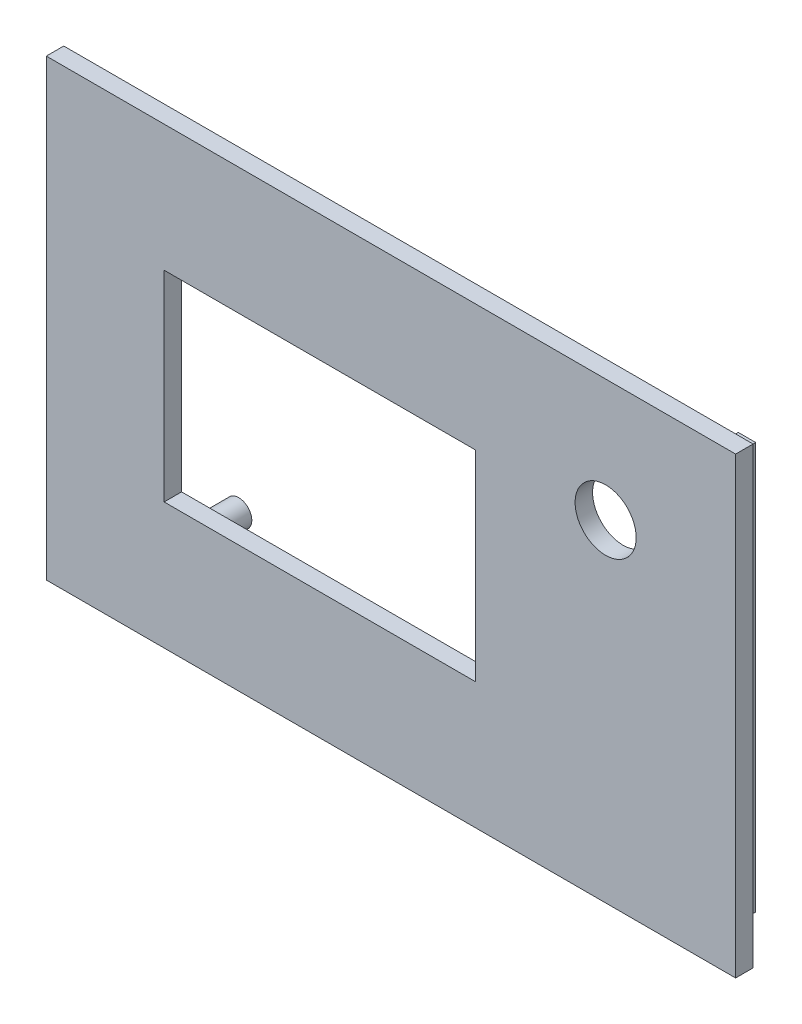
ISO-10303-21;
HEADER;
FILE_DESCRIPTION(('STEP AP214'),'2;1');
FILE_NAME('part.step','',(''),(''),'','','');
FILE_SCHEMA(('AUTOMOTIVE_DESIGN { 1 0 10303 214 1 1 1 1 }'));
ENDSEC;
DATA;
#1=APPLICATION_CONTEXT('core data for automotive mechanical design processes');
#2=APPLICATION_PROTOCOL_DEFINITION('international standard','automotive_design',2000,#1);
#3=PRODUCT_CONTEXT('',#1,'mechanical');
#4=PRODUCT('Part','Part','',(#3));
#5=PRODUCT_RELATED_PRODUCT_CATEGORY('part','',(#4));
#6=PRODUCT_DEFINITION_FORMATION('','',#4);
#7=PRODUCT_DEFINITION_CONTEXT('part definition',#1,'design');
#8=PRODUCT_DEFINITION('design','',#6,#7);
#9=PRODUCT_DEFINITION_SHAPE('','',#8);
#10=(LENGTH_UNIT() NAMED_UNIT(*) SI_UNIT(.MILLI.,.METRE.));
#11=(NAMED_UNIT(*) PLANE_ANGLE_UNIT() SI_UNIT($,.RADIAN.));
#12=(NAMED_UNIT(*) SI_UNIT($,.STERADIAN.) SOLID_ANGLE_UNIT());
#13=UNCERTAINTY_MEASURE_WITH_UNIT(LENGTH_MEASURE(1.E-05),#10,'distance_accuracy_value','');
#14=(GEOMETRIC_REPRESENTATION_CONTEXT(3) GLOBAL_UNCERTAINTY_ASSIGNED_CONTEXT((#13)) GLOBAL_UNIT_ASSIGNED_CONTEXT((#10,
#11,#12)) REPRESENTATION_CONTEXT('',''));
#15=CARTESIAN_POINT('',(0.,0.,0.));
#16=DIRECTION('',(0.,0.,1.));
#17=DIRECTION('',(1.,0.,0.));
#18=AXIS2_PLACEMENT_3D('',#15,#16,#17);
#19=CARTESIAN_POINT('',(0.,0.,0.));
#20=DIRECTION('',(0.,0.,1.));
#21=DIRECTION('',(1.,0.,0.));
#22=AXIS2_PLACEMENT_3D('',#19,#20,#21);
#23=PLANE('',#22);
#24=DIRECTION('',(0.,-1.,0.));
#25=VECTOR('',#24,1.);
#26=CARTESIAN_POINT('',(-59.4904214559387,-2.40229885057471,0.));
#27=LINE('',#26,#25);
#28=CARTESIAN_POINT('',(-59.4904214559387,-2.40229885057471,0.));
#29=VERTEX_POINT('',#28);
#30=CARTESIAN_POINT('',(-59.4904214559387,-54.4022988505747,0.));
#31=VERTEX_POINT('',#30);
#32=EDGE_CURVE('E205',#29,#31,#27,.T.);
#33=ORIENTED_EDGE('',*,*,#32,.F.);
#34=DIRECTION('',(-1.,0.,0.));
#35=VECTOR('',#34,1.);
#36=CARTESIAN_POINT('',(-59.4904214559387,-2.40229885057471,0.));
#37=LINE('',#36,#35);
#38=CARTESIAN_POINT('',(19.5095785440613,-2.40229885057471,0.));
#39=VERTEX_POINT('',#38);
#40=EDGE_CURVE('E216',#39,#29,#37,.T.);
#41=ORIENTED_EDGE('',*,*,#40,.F.);
#42=DIRECTION('',(0.,1.,0.));
#43=VECTOR('',#42,1.);
#44=CARTESIAN_POINT('',(19.5095785440613,-2.40229885057471,0.));
#45=LINE('',#44,#43);
#46=CARTESIAN_POINT('',(19.5095785440613,-54.4022988505747,0.));
#47=VERTEX_POINT('',#46);
#48=EDGE_CURVE('E227',#47,#39,#45,.T.);
#49=ORIENTED_EDGE('',*,*,#48,.F.);
#50=DIRECTION('',(1.,0.,0.));
#51=VECTOR('',#50,1.);
#52=CARTESIAN_POINT('',(-59.4904214559387,-54.4022988505747,0.));
#53=LINE('',#52,#51);
#54=EDGE_CURVE('E225',#31,#47,#53,.T.);
#55=ORIENTED_EDGE('',*,*,#54,.F.);
#56=EDGE_LOOP('',(#33,#41,#49,#55));
#57=FACE_BOUND('',#56,.T.);
#58=DIRECTION('',(-1.,0.,0.));
#59=VECTOR('',#58,1.);
#60=CARTESIAN_POINT('',(-45.9869726842383,-16.9022988505747,0.));
#61=LINE('',#60,#59);
#62=CARTESIAN_POINT('',(-10.2869726842383,-16.9022988505747,0.));
#63=VERTEX_POINT('',#62);
#64=CARTESIAN_POINT('',(-45.9869726842383,-16.9022988505747,0.));
#65=VERTEX_POINT('',#64);
#66=EDGE_CURVE('E190',#63,#65,#61,.T.);
#67=ORIENTED_EDGE('',*,*,#66,.T.);
#68=DIRECTION('',(0.,-1.,0.));
#69=VECTOR('',#68,1.);
#70=CARTESIAN_POINT('',(-45.9869726842383,-16.9022988505747,0.));
#71=LINE('',#70,#69);
#72=CARTESIAN_POINT('',(-45.9869726842383,-39.9022988505747,0.));
#73=VERTEX_POINT('',#72);
#74=EDGE_CURVE('E180',#65,#73,#71,.T.);
#75=ORIENTED_EDGE('',*,*,#74,.T.);
#76=DIRECTION('',(1.,0.,0.));
#77=VECTOR('',#76,1.);
#78=CARTESIAN_POINT('',(-45.9869726842383,-39.9022988505747,0.));
#79=LINE('',#78,#77);
#80=CARTESIAN_POINT('',(-10.2869726842383,-39.9022988505747,0.));
#81=VERTEX_POINT('',#80);
#82=EDGE_CURVE('E183',#73,#81,#79,.T.);
#83=ORIENTED_EDGE('',*,*,#82,.T.);
#84=DIRECTION('',(0.,1.,0.));
#85=VECTOR('',#84,1.);
#86=CARTESIAN_POINT('',(-10.2869726842383,-16.9022988505747,0.));
#87=LINE('',#86,#85);
#88=EDGE_CURVE('E187',#81,#63,#87,.T.);
#89=ORIENTED_EDGE('',*,*,#88,.T.);
#90=EDGE_LOOP('',(#67,#75,#83,#89));
#91=FACE_BOUND('',#90,.T.);
#92=CARTESIAN_POINT('',(4.61130292991151,-16.4022988505747,0.));
#93=DIRECTION('',(0.,0.,1.));
#94=DIRECTION('',(1.,0.,0.));
#95=AXIS2_PLACEMENT_3D('',#92,#93,#94);
#96=CIRCLE('',#95,3.5);
#97=CARTESIAN_POINT('',(8.1113029299115,-16.4022988505747,0.));
#98=VERTEX_POINT('',#97);
#99=EDGE_CURVE('E174',#98,#98,#96,.T.);
#100=ORIENTED_EDGE('',*,*,#99,.T.);
#101=EDGE_LOOP('',(#100));
#102=FACE_BOUND('',#101,.T.);
#103=CARTESIAN_POINT('',(-43.4369726842383,-14.1022988505747,0.));
#104=DIRECTION('',(0.,0.,1.));
#105=DIRECTION('',(1.,0.,0.));
#106=AXIS2_PLACEMENT_3D('',#103,#104,#105);
#107=CIRCLE('',#106,1.50000000000001);
#108=CARTESIAN_POINT('',(-41.9369726842383,-14.1022988505747,0.));
#109=VERTEX_POINT('',#108);
#110=EDGE_CURVE('E241',#109,#109,#107,.F.);
#111=ORIENTED_EDGE('',*,*,#110,.F.);
#112=EDGE_LOOP('',(#111));
#113=FACE_BOUND('',#112,.T.);
#114=CARTESIAN_POINT('',(-43.4369726842383,-42.7022988505747,0.));
#115=DIRECTION('',(0.,0.,1.));
#116=DIRECTION('',(1.,0.,0.));
#117=AXIS2_PLACEMENT_3D('',#114,#115,#116);
#118=CIRCLE('',#117,1.50000000000002);
#119=CARTESIAN_POINT('',(-41.9369726842383,-42.7022988505747,0.));
#120=VERTEX_POINT('',#119);
#121=EDGE_CURVE('E244',#120,#120,#118,.F.);
#122=ORIENTED_EDGE('',*,*,#121,.F.);
#123=EDGE_LOOP('',(#122));
#124=FACE_BOUND('',#123,.T.);
#125=CARTESIAN_POINT('',(-12.8369726842383,-14.1022988505747,0.));
#126=DIRECTION('',(0.,0.,1.));
#127=DIRECTION('',(1.,0.,0.));
#128=AXIS2_PLACEMENT_3D('',#125,#126,#127);
#129=CIRCLE('',#128,1.50000000000001);
#130=CARTESIAN_POINT('',(-11.3369726842383,-14.1022988505747,0.));
#131=VERTEX_POINT('',#130);
#132=EDGE_CURVE('E42',#131,#131,#129,.F.);
#133=ORIENTED_EDGE('',*,*,#132,.F.);
#134=EDGE_LOOP('',(#133));
#135=FACE_BOUND('',#134,.T.);
#136=CARTESIAN_POINT('',(-12.8369726842383,-42.7022988505747,0.));
#137=DIRECTION('',(0.,0.,1.));
#138=DIRECTION('',(1.,0.,0.));
#139=AXIS2_PLACEMENT_3D('',#136,#137,#138);
#140=CIRCLE('',#139,1.50000000000001);
#141=CARTESIAN_POINT('',(-11.3369726842383,-42.7022988505747,0.));
#142=VERTEX_POINT('',#141);
#143=EDGE_CURVE('E11',#142,#142,#140,.F.);
#144=ORIENTED_EDGE('',*,*,#143,.F.);
#145=EDGE_LOOP('',(#144));
#146=FACE_BOUND('',#145,.T.);
#147=DIRECTION('',(1.,0.,0.));
#148=VECTOR('',#147,1.);
#149=CARTESIAN_POINT('',(16.8095785440613,-5.10229885057473,0.));
#150=LINE('',#149,#148);
#151=CARTESIAN_POINT('',(14.8095785440613,-5.10229885057471,0.));
#152=VERTEX_POINT('',#151);
#153=CARTESIAN_POINT('',(16.8095785440613,-5.10229885057473,0.));
#154=VERTEX_POINT('',#153);
#155=EDGE_CURVE('E155',#152,#154,#150,.T.);
#156=ORIENTED_EDGE('',*,*,#155,.F.);
#157=DIRECTION('',(0.,1.,0.));
#158=VECTOR('',#157,1.);
#159=CARTESIAN_POINT('',(14.8095785440613,-5.10229885057471,0.));
#160=LINE('',#159,#158);
#161=CARTESIAN_POINT('',(14.8095785440613,-49.7022988505747,0.));
#162=VERTEX_POINT('',#161);
#163=EDGE_CURVE('E152',#162,#152,#160,.T.);
#164=ORIENTED_EDGE('',*,*,#163,.F.);
#165=DIRECTION('',(1.,0.,0.));
#166=VECTOR('',#165,1.);
#167=CARTESIAN_POINT('',(14.8095785440613,-49.7022988505747,0.));
#168=LINE('',#167,#166);
#169=CARTESIAN_POINT('',(-56.7904214559387,-49.7022988505747,0.));
#170=VERTEX_POINT('',#169);
#171=EDGE_CURVE('E265',#170,#162,#168,.T.);
#172=ORIENTED_EDGE('',*,*,#171,.F.);
#173=DIRECTION('',(0.,1.,0.));
#174=VECTOR('',#173,1.);
#175=CARTESIAN_POINT('',(-56.7904214559387,-51.7022988505747,0.));
#176=LINE('',#175,#174);
#177=CARTESIAN_POINT('',(-56.7904214559387,-51.7022988505747,0.));
#178=VERTEX_POINT('',#177);
#179=EDGE_CURVE('E282',#178,#170,#176,.T.);
#180=ORIENTED_EDGE('',*,*,#179,.F.);
#181=DIRECTION('',(-1.,0.,0.));
#182=VECTOR('',#181,1.);
#183=CARTESIAN_POINT('',(16.8095785440613,-51.7022988505747,0.));
#184=LINE('',#183,#182);
#185=CARTESIAN_POINT('',(16.8095785440613,-51.7022988505747,0.));
#186=VERTEX_POINT('',#185);
#187=EDGE_CURVE('E54',#186,#178,#184,.T.);
#188=ORIENTED_EDGE('',*,*,#187,.F.);
#189=DIRECTION('',(0.,-1.,0.));
#190=VECTOR('',#189,1.);
#191=CARTESIAN_POINT('',(16.8095785440613,-5.10229885057473,0.));
#192=LINE('',#191,#190);
#193=EDGE_CURVE('E49',#154,#186,#192,.T.);
#194=ORIENTED_EDGE('',*,*,#193,.F.);
#195=EDGE_LOOP('',(#156,#164,#172,#180,#188,#194));
#196=FACE_BOUND('',#195,.T.);
#197=ADVANCED_FACE('F34',(#57,#91,#102,#113,#124,#135,#146,#196),#23,.F.);
#198=CARTESIAN_POINT('',(-59.4904214559387,-2.40229885057471,2.));
#199=DIRECTION('',(1.,0.,0.));
#200=DIRECTION('',(0.,1.,0.));
#201=AXIS2_PLACEMENT_3D('',#198,#199,#200);
#202=PLANE('',#201);
#203=ORIENTED_EDGE('',*,*,#32,.T.);
#204=DIRECTION('',(0.,0.,-1.));
#205=VECTOR('',#204,1.);
#206=CARTESIAN_POINT('',(-59.4904214559387,-54.4022988505747,2.));
#207=LINE('',#206,#205);
#208=CARTESIAN_POINT('',(-59.4904214559387,-54.4022988505747,2.));
#209=VERTEX_POINT('',#208);
#210=EDGE_CURVE('E238',#209,#31,#207,.T.);
#211=ORIENTED_EDGE('',*,*,#210,.F.);
#212=DIRECTION('',(0.,-1.,0.));
#213=VECTOR('',#212,1.);
#214=CARTESIAN_POINT('',(-59.4904214559387,-2.40229885057471,2.));
#215=LINE('',#214,#213);
#216=CARTESIAN_POINT('',(-59.4904214559387,-2.40229885057471,2.));
#217=VERTEX_POINT('',#216);
#218=EDGE_CURVE('E212',#217,#209,#215,.T.);
#219=ORIENTED_EDGE('',*,*,#218,.F.);
#220=DIRECTION('',(0.,0.,-1.));
#221=VECTOR('',#220,1.);
#222=CARTESIAN_POINT('',(-59.4904214559387,-2.40229885057471,2.));
#223=LINE('',#222,#221);
#224=EDGE_CURVE('E222',#217,#29,#223,.T.);
#225=ORIENTED_EDGE('',*,*,#224,.T.);
#226=EDGE_LOOP('',(#203,#211,#219,#225));
#227=FACE_BOUND('',#226,.T.);
#228=ADVANCED_FACE('F36',(#227),#202,.F.);
#229=CARTESIAN_POINT('',(-59.4904214559387,-54.4022988505747,2.));
#230=DIRECTION('',(0.,1.,0.));
#231=DIRECTION('',(0.,0.,1.));
#232=AXIS2_PLACEMENT_3D('',#229,#230,#231);
#233=PLANE('',#232);
#234=ORIENTED_EDGE('',*,*,#54,.T.);
#235=DIRECTION('',(0.,0.,-1.));
#236=VECTOR('',#235,1.);
#237=CARTESIAN_POINT('',(19.5095785440613,-54.4022988505747,2.));
#238=LINE('',#237,#236);
#239=CARTESIAN_POINT('',(19.5095785440613,-54.4022988505747,2.));
#240=VERTEX_POINT('',#239);
#241=EDGE_CURVE('E235',#240,#47,#238,.T.);
#242=ORIENTED_EDGE('',*,*,#241,.F.);
#243=DIRECTION('',(1.,0.,0.));
#244=VECTOR('',#243,1.);
#245=CARTESIAN_POINT('',(-59.4904214559387,-54.4022988505747,2.));
#246=LINE('',#245,#244);
#247=EDGE_CURVE('E215',#209,#240,#246,.T.);
#248=ORIENTED_EDGE('',*,*,#247,.F.);
#249=ORIENTED_EDGE('',*,*,#210,.T.);
#250=EDGE_LOOP('',(#234,#242,#248,#249));
#251=FACE_BOUND('',#250,.T.);
#252=ADVANCED_FACE('F372',(#251),#233,.F.);
#253=CARTESIAN_POINT('',(19.5095785440613,-2.40229885057471,2.));
#254=DIRECTION('',(-1.,0.,0.));
#255=DIRECTION('',(0.,-1.,0.));
#256=AXIS2_PLACEMENT_3D('',#253,#254,#255);
#257=PLANE('',#256);
#258=ORIENTED_EDGE('',*,*,#48,.T.);
#259=DIRECTION('',(0.,0.,-1.));
#260=VECTOR('',#259,1.);
#261=CARTESIAN_POINT('',(19.5095785440613,-2.40229885057471,2.));
#262=LINE('',#261,#260);
#263=CARTESIAN_POINT('',(19.5095785440613,-2.40229885057471,2.));
#264=VERTEX_POINT('',#263);
#265=EDGE_CURVE('E232',#264,#39,#262,.T.);
#266=ORIENTED_EDGE('',*,*,#265,.F.);
#267=DIRECTION('',(0.,1.,0.));
#268=VECTOR('',#267,1.);
#269=CARTESIAN_POINT('',(19.5095785440613,-2.40229885057471,2.));
#270=LINE('',#269,#268);
#271=EDGE_CURVE('E218',#240,#264,#270,.T.);
#272=ORIENTED_EDGE('',*,*,#271,.F.);
#273=ORIENTED_EDGE('',*,*,#241,.T.);
#274=EDGE_LOOP('',(#258,#266,#272,#273));
#275=FACE_BOUND('',#274,.T.);
#276=ADVANCED_FACE('F369',(#275),#257,.F.);
#277=CARTESIAN_POINT('',(-59.4904214559387,-2.40229885057471,2.));
#278=DIRECTION('',(0.,-1.,0.));
#279=DIRECTION('',(0.,0.,-1.));
#280=AXIS2_PLACEMENT_3D('',#277,#278,#279);
#281=PLANE('',#280);
#282=ORIENTED_EDGE('',*,*,#40,.T.);
#283=ORIENTED_EDGE('',*,*,#224,.F.);
#284=DIRECTION('',(-1.,0.,0.));
#285=VECTOR('',#284,1.);
#286=CARTESIAN_POINT('',(-59.4904214559387,-2.40229885057471,2.));
#287=LINE('',#286,#285);
#288=EDGE_CURVE('E220',#264,#217,#287,.T.);
#289=ORIENTED_EDGE('',*,*,#288,.F.);
#290=ORIENTED_EDGE('',*,*,#265,.T.);
#291=EDGE_LOOP('',(#282,#283,#289,#290));
#292=FACE_BOUND('',#291,.T.);
#293=ADVANCED_FACE('F364',(#292),#281,.F.);
#294=CARTESIAN_POINT('',(0.,0.,2.));
#295=DIRECTION('',(0.,0.,1.));
#296=DIRECTION('',(1.,0.,0.));
#297=AXIS2_PLACEMENT_3D('',#294,#295,#296);
#298=PLANE('',#297);
#299=CARTESIAN_POINT('',(4.61130292991151,-16.4022988505747,2.));
#300=DIRECTION('',(0.,0.,1.));
#301=DIRECTION('',(1.,0.,0.));
#302=AXIS2_PLACEMENT_3D('',#299,#300,#301);
#303=CIRCLE('',#302,3.5);
#304=CARTESIAN_POINT('',(8.1113029299115,-16.4022988505747,2.));
#305=VERTEX_POINT('',#304);
#306=EDGE_CURVE('E173',#305,#305,#303,.T.);
#307=ORIENTED_EDGE('',*,*,#306,.F.);
#308=EDGE_LOOP('',(#307));
#309=FACE_BOUND('',#308,.T.);
#310=DIRECTION('',(0.,-1.,0.));
#311=VECTOR('',#310,1.);
#312=CARTESIAN_POINT('',(-45.9869726842383,-16.9022988505747,2.));
#313=LINE('',#312,#311);
#314=CARTESIAN_POINT('',(-45.9869726842383,-16.9022988505747,2.));
#315=VERTEX_POINT('',#314);
#316=CARTESIAN_POINT('',(-45.9869726842383,-39.9022988505747,2.));
#317=VERTEX_POINT('',#316);
#318=EDGE_CURVE('E177',#315,#317,#313,.T.);
#319=ORIENTED_EDGE('',*,*,#318,.F.);
#320=DIRECTION('',(-1.,0.,0.));
#321=VECTOR('',#320,1.);
#322=CARTESIAN_POINT('',(-45.9869726842383,-16.9022988505747,2.));
#323=LINE('',#322,#321);
#324=CARTESIAN_POINT('',(-10.2869726842383,-16.9022988505747,2.));
#325=VERTEX_POINT('',#324);
#326=EDGE_CURVE('E184',#325,#315,#323,.T.);
#327=ORIENTED_EDGE('',*,*,#326,.F.);
#328=DIRECTION('',(0.,1.,0.));
#329=VECTOR('',#328,1.);
#330=CARTESIAN_POINT('',(-10.2869726842383,-16.9022988505747,2.));
#331=LINE('',#330,#329);
#332=CARTESIAN_POINT('',(-10.2869726842383,-39.9022988505747,2.));
#333=VERTEX_POINT('',#332);
#334=EDGE_CURVE('E198',#333,#325,#331,.T.);
#335=ORIENTED_EDGE('',*,*,#334,.F.);
#336=DIRECTION('',(1.,0.,0.));
#337=VECTOR('',#336,1.);
#338=CARTESIAN_POINT('',(-45.9869726842383,-39.9022988505747,2.));
#339=LINE('',#338,#337);
#340=EDGE_CURVE('E195',#317,#333,#339,.T.);
#341=ORIENTED_EDGE('',*,*,#340,.F.);
#342=EDGE_LOOP('',(#319,#327,#335,#341));
#343=FACE_BOUND('',#342,.T.);
#344=ORIENTED_EDGE('',*,*,#218,.T.);
#345=ORIENTED_EDGE('',*,*,#247,.T.);
#346=ORIENTED_EDGE('',*,*,#271,.T.);
#347=ORIENTED_EDGE('',*,*,#288,.T.);
#348=EDGE_LOOP('',(#344,#345,#346,#347));
#349=FACE_BOUND('',#348,.T.);
#350=ADVANCED_FACE('F361',(#309,#343,#349),#298,.T.);
#351=CARTESIAN_POINT('',(-45.9869726842383,-16.9022988505747,0.));
#352=DIRECTION('',(-1.,0.,0.));
#353=DIRECTION('',(0.,0.,1.));
#354=AXIS2_PLACEMENT_3D('',#351,#352,#353);
#355=PLANE('',#354);
#356=ORIENTED_EDGE('',*,*,#318,.T.);
#357=DIRECTION('',(0.,0.,1.));
#358=VECTOR('',#357,1.);
#359=CARTESIAN_POINT('',(-45.9869726842383,-39.9022988505747,0.));
#360=LINE('',#359,#358);
#361=EDGE_CURVE('E193',#73,#317,#360,.T.);
#362=ORIENTED_EDGE('',*,*,#361,.F.);
#363=ORIENTED_EDGE('',*,*,#74,.F.);
#364=DIRECTION('',(0.,0.,1.));
#365=VECTOR('',#364,1.);
#366=CARTESIAN_POINT('',(-45.9869726842383,-16.9022988505747,0.));
#367=LINE('',#366,#365);
#368=EDGE_CURVE('E203',#65,#315,#367,.T.);
#369=ORIENTED_EDGE('',*,*,#368,.T.);
#370=EDGE_LOOP('',(#356,#362,#363,#369));
#371=FACE_BOUND('',#370,.T.);
#372=ADVANCED_FACE('F351',(#371),#355,.F.);
#373=CARTESIAN_POINT('',(-45.9869726842383,-16.9022988505747,0.));
#374=DIRECTION('',(0.,1.,0.));
#375=DIRECTION('',(-1.,0.,0.));
#376=AXIS2_PLACEMENT_3D('',#373,#374,#375);
#377=PLANE('',#376);
#378=ORIENTED_EDGE('',*,*,#326,.T.);
#379=ORIENTED_EDGE('',*,*,#368,.F.);
#380=ORIENTED_EDGE('',*,*,#66,.F.);
#381=DIRECTION('',(0.,0.,1.));
#382=VECTOR('',#381,1.);
#383=CARTESIAN_POINT('',(-10.2869726842383,-16.9022988505747,0.));
#384=LINE('',#383,#382);
#385=EDGE_CURVE('E206',#63,#325,#384,.T.);
#386=ORIENTED_EDGE('',*,*,#385,.T.);
#387=EDGE_LOOP('',(#378,#379,#380,#386));
#388=FACE_BOUND('',#387,.T.);
#389=ADVANCED_FACE('F347',(#388),#377,.F.);
#390=CARTESIAN_POINT('',(-10.2869726842383,-16.9022988505747,0.));
#391=DIRECTION('',(1.,0.,0.));
#392=DIRECTION('',(0.,0.,-1.));
#393=AXIS2_PLACEMENT_3D('',#390,#391,#392);
#394=PLANE('',#393);
#395=ORIENTED_EDGE('',*,*,#334,.T.);
#396=ORIENTED_EDGE('',*,*,#385,.F.);
#397=ORIENTED_EDGE('',*,*,#88,.F.);
#398=DIRECTION('',(0.,0.,1.));
#399=VECTOR('',#398,1.);
#400=CARTESIAN_POINT('',(-10.2869726842383,-39.9022988505747,0.));
#401=LINE('',#400,#399);
#402=EDGE_CURVE('E208',#81,#333,#401,.T.);
#403=ORIENTED_EDGE('',*,*,#402,.T.);
#404=EDGE_LOOP('',(#395,#396,#397,#403));
#405=FACE_BOUND('',#404,.T.);
#406=ADVANCED_FACE('F350',(#405),#394,.F.);
#407=CARTESIAN_POINT('',(-45.9869726842383,-39.9022988505747,0.));
#408=DIRECTION('',(0.,-1.,0.));
#409=DIRECTION('',(1.,0.,0.));
#410=AXIS2_PLACEMENT_3D('',#407,#408,#409);
#411=PLANE('',#410);
#412=ORIENTED_EDGE('',*,*,#340,.T.);
#413=ORIENTED_EDGE('',*,*,#402,.F.);
#414=ORIENTED_EDGE('',*,*,#82,.F.);
#415=ORIENTED_EDGE('',*,*,#361,.T.);
#416=EDGE_LOOP('',(#412,#413,#414,#415));
#417=FACE_BOUND('',#416,.T.);
#418=ADVANCED_FACE('F345',(#417),#411,.F.);
#419=CARTESIAN_POINT('',(4.61130292991151,-16.4022988505747,0.));
#420=DIRECTION('',(0.,0.,1.));
#421=DIRECTION('',(1.,0.,0.));
#422=AXIS2_PLACEMENT_3D('',#419,#420,#421);
#423=CYLINDRICAL_SURFACE('',#422,3.5);
#424=ORIENTED_EDGE('',*,*,#99,.F.);
#425=EDGE_LOOP('',(#424));
#426=FACE_BOUND('',#425,.T.);
#427=ORIENTED_EDGE('',*,*,#306,.T.);
#428=EDGE_LOOP('',(#427));
#429=FACE_BOUND('',#428,.T.);
#430=ADVANCED_FACE('F341',(#426,#429),#423,.F.);
#431=CARTESIAN_POINT('',(-43.4369726842383,-14.1022988505747,-4.));
#432=DIRECTION('',(0.,0.,1.));
#433=DIRECTION('',(1.,0.,0.));
#434=AXIS2_PLACEMENT_3D('',#431,#432,#433);
#435=CYLINDRICAL_SURFACE('',#434,1.50000000000001);
#436=CARTESIAN_POINT('',(-43.4369726842383,-14.1022988505747,-4.));
#437=DIRECTION('',(0.,0.,-1.));
#438=DIRECTION('',(-1.,0.,0.));
#439=AXIS2_PLACEMENT_3D('',#436,#437,#438);
#440=CIRCLE('',#439,1.50000000000001);
#441=CARTESIAN_POINT('',(-44.9369726842383,-14.1022988505747,-4.));
#442=VERTEX_POINT('',#441);
#443=EDGE_CURVE('E170',#442,#442,#440,.T.);
#444=ORIENTED_EDGE('',*,*,#443,.F.);
#445=EDGE_LOOP('',(#444));
#446=FACE_BOUND('',#445,.T.);
#447=ORIENTED_EDGE('',*,*,#110,.T.);
#448=EDGE_LOOP('',(#447));
#449=FACE_BOUND('',#448,.T.);
#450=ADVANCED_FACE('F337',(#446,#449),#435,.T.);
#451=CARTESIAN_POINT('',(-43.4369726842383,-14.1022988505747,-4.));
#452=DIRECTION('',(0.,0.,-1.));
#453=DIRECTION('',(-1.,0.,0.));
#454=AXIS2_PLACEMENT_3D('',#451,#452,#453);
#455=PLANE('',#454);
#456=ORIENTED_EDGE('',*,*,#443,.T.);
#457=EDGE_LOOP('',(#456));
#458=FACE_BOUND('',#457,.T.);
#459=ADVANCED_FACE('F333',(#458),#455,.T.);
#460=CARTESIAN_POINT('',(-43.4369726842383,-42.7022988505747,-4.));
#461=DIRECTION('',(0.,0.,1.));
#462=DIRECTION('',(1.,0.,0.));
#463=AXIS2_PLACEMENT_3D('',#460,#461,#462);
#464=CYLINDRICAL_SURFACE('',#463,1.50000000000002);
#465=CARTESIAN_POINT('',(-43.4369726842383,-42.7022988505747,-4.));
#466=DIRECTION('',(0.,0.,-1.));
#467=DIRECTION('',(-1.,0.,0.));
#468=AXIS2_PLACEMENT_3D('',#465,#466,#467);
#469=CIRCLE('',#468,1.50000000000002);
#470=CARTESIAN_POINT('',(-44.9369726842383,-42.7022988505747,-4.));
#471=VERTEX_POINT('',#470);
#472=EDGE_CURVE('E167',#471,#471,#469,.T.);
#473=ORIENTED_EDGE('',*,*,#472,.F.);
#474=EDGE_LOOP('',(#473));
#475=FACE_BOUND('',#474,.T.);
#476=ORIENTED_EDGE('',*,*,#121,.T.);
#477=EDGE_LOOP('',(#476));
#478=FACE_BOUND('',#477,.T.);
#479=ADVANCED_FACE('F329',(#475,#478),#464,.T.);
#480=CARTESIAN_POINT('',(-43.4369726842383,-42.7022988505747,-4.));
#481=DIRECTION('',(0.,0.,-1.));
#482=DIRECTION('',(-1.,0.,0.));
#483=AXIS2_PLACEMENT_3D('',#480,#481,#482);
#484=PLANE('',#483);
#485=ORIENTED_EDGE('',*,*,#472,.T.);
#486=EDGE_LOOP('',(#485));
#487=FACE_BOUND('',#486,.T.);
#488=ADVANCED_FACE('F325',(#487),#484,.T.);
#489=CARTESIAN_POINT('',(-12.8369726842383,-14.1022988505747,-4.));
#490=DIRECTION('',(0.,0.,1.));
#491=DIRECTION('',(1.,0.,0.));
#492=AXIS2_PLACEMENT_3D('',#489,#490,#491);
#493=CYLINDRICAL_SURFACE('',#492,1.50000000000001);
#494=CARTESIAN_POINT('',(-12.8369726842383,-14.1022988505747,-4.));
#495=DIRECTION('',(0.,0.,-1.));
#496=DIRECTION('',(-1.,0.,0.));
#497=AXIS2_PLACEMENT_3D('',#494,#495,#496);
#498=CIRCLE('',#497,1.50000000000001);
#499=CARTESIAN_POINT('',(-14.3369726842383,-14.1022988505747,-4.));
#500=VERTEX_POINT('',#499);
#501=EDGE_CURVE('E159',#500,#500,#498,.T.);
#502=ORIENTED_EDGE('',*,*,#501,.F.);
#503=EDGE_LOOP('',(#502));
#504=FACE_BOUND('',#503,.T.);
#505=ORIENTED_EDGE('',*,*,#132,.T.);
#506=EDGE_LOOP('',(#505));
#507=FACE_BOUND('',#506,.T.);
#508=ADVANCED_FACE('F249',(#504,#507),#493,.T.);
#509=CARTESIAN_POINT('',(-12.8369726842383,-14.1022988505747,-4.));
#510=DIRECTION('',(0.,0.,-1.));
#511=DIRECTION('',(-1.,0.,0.));
#512=AXIS2_PLACEMENT_3D('',#509,#510,#511);
#513=PLANE('',#512);
#514=ORIENTED_EDGE('',*,*,#501,.T.);
#515=EDGE_LOOP('',(#514));
#516=FACE_BOUND('',#515,.T.);
#517=ADVANCED_FACE('F318',(#516),#513,.T.);
#518=CARTESIAN_POINT('',(-12.8369726842383,-42.7022988505747,-4.));
#519=DIRECTION('',(0.,0.,1.));
#520=DIRECTION('',(1.,0.,0.));
#521=AXIS2_PLACEMENT_3D('',#518,#519,#520);
#522=CYLINDRICAL_SURFACE('',#521,1.50000000000001);
#523=CARTESIAN_POINT('',(-12.8369726842383,-42.7022988505747,-4.));
#524=DIRECTION('',(0.,0.,-1.));
#525=DIRECTION('',(-1.,0.,0.));
#526=AXIS2_PLACEMENT_3D('',#523,#524,#525);
#527=CIRCLE('',#526,1.50000000000001);
#528=CARTESIAN_POINT('',(-14.3369726842383,-42.7022988505747,-4.));
#529=VERTEX_POINT('',#528);
#530=EDGE_CURVE('E156',#529,#529,#527,.T.);
#531=ORIENTED_EDGE('',*,*,#530,.F.);
#532=EDGE_LOOP('',(#531));
#533=FACE_BOUND('',#532,.T.);
#534=ORIENTED_EDGE('',*,*,#143,.T.);
#535=EDGE_LOOP('',(#534));
#536=FACE_BOUND('',#535,.T.);
#537=ADVANCED_FACE('F314',(#533,#536),#522,.T.);
#538=CARTESIAN_POINT('',(-12.8369726842383,-42.7022988505747,-4.));
#539=DIRECTION('',(0.,0.,-1.));
#540=DIRECTION('',(-1.,0.,0.));
#541=AXIS2_PLACEMENT_3D('',#538,#539,#540);
#542=PLANE('',#541);
#543=ORIENTED_EDGE('',*,*,#530,.T.);
#544=EDGE_LOOP('',(#543));
#545=FACE_BOUND('',#544,.T.);
#546=ADVANCED_FACE('F311',(#545),#542,.T.);
#547=CARTESIAN_POINT('',(16.8095785440613,-5.10229885057473,-3.));
#548=DIRECTION('',(0.,-1.,0.));
#549=DIRECTION('',(1.,0.,0.));
#550=AXIS2_PLACEMENT_3D('',#547,#548,#549);
#551=PLANE('',#550);
#552=ORIENTED_EDGE('',*,*,#155,.T.);
#553=DIRECTION('',(0.,0.,1.));
#554=VECTOR('',#553,1.);
#555=CARTESIAN_POINT('',(16.8095785440613,-5.10229885057473,-3.));
#556=LINE('',#555,#554);
#557=CARTESIAN_POINT('',(16.8095785440613,-5.10229885057473,-3.));
#558=VERTEX_POINT('',#557);
#559=EDGE_CURVE('E136',#558,#154,#556,.T.);
#560=ORIENTED_EDGE('',*,*,#559,.F.);
#561=DIRECTION('',(1.,0.,0.));
#562=VECTOR('',#561,1.);
#563=CARTESIAN_POINT('',(16.8095785440613,-5.10229885057473,-3.));
#564=LINE('',#563,#562);
#565=CARTESIAN_POINT('',(14.8095785440613,-5.10229885057471,-3.));
#566=VERTEX_POINT('',#565);
#567=EDGE_CURVE('E143',#566,#558,#564,.T.);
#568=ORIENTED_EDGE('',*,*,#567,.F.);
#569=DIRECTION('',(0.,0.,1.));
#570=VECTOR('',#569,1.);
#571=CARTESIAN_POINT('',(14.8095785440613,-5.10229885057471,-3.));
#572=LINE('',#571,#570);
#573=EDGE_CURVE('E262',#566,#152,#572,.T.);
#574=ORIENTED_EDGE('',*,*,#573,.T.);
#575=EDGE_LOOP('',(#552,#560,#568,#574));
#576=FACE_BOUND('',#575,.T.);
#577=ADVANCED_FACE('F154',(#576),#551,.F.);
#578=CARTESIAN_POINT('',(16.8095785440613,-5.10229885057473,-3.));
#579=DIRECTION('',(-1.,0.,0.));
#580=DIRECTION('',(0.,-1.,0.));
#581=AXIS2_PLACEMENT_3D('',#578,#579,#580);
#582=PLANE('',#581);
#583=ORIENTED_EDGE('',*,*,#193,.T.);
#584=DIRECTION('',(0.,0.,1.));
#585=VECTOR('',#584,1.);
#586=CARTESIAN_POINT('',(16.8095785440613,-51.7022988505747,-3.));
#587=LINE('',#586,#585);
#588=CARTESIAN_POINT('',(16.8095785440613,-51.7022988505747,-3.));
#589=VERTEX_POINT('',#588);
#590=EDGE_CURVE('E139',#589,#186,#587,.T.);
#591=ORIENTED_EDGE('',*,*,#590,.F.);
#592=DIRECTION('',(0.,-1.,0.));
#593=VECTOR('',#592,1.);
#594=CARTESIAN_POINT('',(16.8095785440613,-5.10229885057473,-3.));
#595=LINE('',#594,#593);
#596=EDGE_CURVE('E132',#558,#589,#595,.T.);
#597=ORIENTED_EDGE('',*,*,#596,.F.);
#598=ORIENTED_EDGE('',*,*,#559,.T.);
#599=EDGE_LOOP('',(#583,#591,#597,#598));
#600=FACE_BOUND('',#599,.T.);
#601=ADVANCED_FACE('F134',(#600),#582,.F.);
#602=CARTESIAN_POINT('',(16.8095785440613,-51.7022988505747,-3.));
#603=DIRECTION('',(0.,1.,0.));
#604=DIRECTION('',(-1.,0.,0.));
#605=AXIS2_PLACEMENT_3D('',#602,#603,#604);
#606=PLANE('',#605);
#607=ORIENTED_EDGE('',*,*,#187,.T.);
#608=DIRECTION('',(0.,0.,1.));
#609=VECTOR('',#608,1.);
#610=CARTESIAN_POINT('',(-56.7904214559387,-51.7022988505747,-3.));
#611=LINE('',#610,#609);
#612=CARTESIAN_POINT('',(-56.7904214559387,-51.7022988505747,-3.));
#613=VERTEX_POINT('',#612);
#614=EDGE_CURVE('E161',#613,#178,#611,.T.);
#615=ORIENTED_EDGE('',*,*,#614,.F.);
#616=DIRECTION('',(-1.,0.,0.));
#617=VECTOR('',#616,1.);
#618=CARTESIAN_POINT('',(16.8095785440613,-51.7022988505747,-3.));
#619=LINE('',#618,#617);
#620=EDGE_CURVE('E142',#589,#613,#619,.T.);
#621=ORIENTED_EDGE('',*,*,#620,.F.);
#622=ORIENTED_EDGE('',*,*,#590,.T.);
#623=EDGE_LOOP('',(#607,#615,#621,#622));
#624=FACE_BOUND('',#623,.T.);
#625=ADVANCED_FACE('F285',(#624),#606,.F.);
#626=CARTESIAN_POINT('',(-56.7904214559387,-51.7022988505747,-3.));
#627=DIRECTION('',(1.,0.,0.));
#628=DIRECTION('',(0.,0.,-1.));
#629=AXIS2_PLACEMENT_3D('',#626,#627,#628);
#630=PLANE('',#629);
#631=ORIENTED_EDGE('',*,*,#179,.T.);
#632=DIRECTION('',(0.,0.,1.));
#633=VECTOR('',#632,1.);
#634=CARTESIAN_POINT('',(-56.7904214559387,-49.7022988505747,-3.));
#635=LINE('',#634,#633);
#636=CARTESIAN_POINT('',(-56.7904214559387,-49.7022988505747,-3.));
#637=VERTEX_POINT('',#636);
#638=EDGE_CURVE('E268',#637,#170,#635,.T.);
#639=ORIENTED_EDGE('',*,*,#638,.F.);
#640=DIRECTION('',(0.,1.,0.));
#641=VECTOR('',#640,1.);
#642=CARTESIAN_POINT('',(-56.7904214559387,-51.7022988505747,-3.));
#643=LINE('',#642,#641);
#644=EDGE_CURVE('E283',#613,#637,#643,.T.);
#645=ORIENTED_EDGE('',*,*,#644,.F.);
#646=ORIENTED_EDGE('',*,*,#614,.T.);
#647=EDGE_LOOP('',(#631,#639,#645,#646));
#648=FACE_BOUND('',#647,.T.);
#649=ADVANCED_FACE('F280',(#648),#630,.F.);
#650=CARTESIAN_POINT('',(14.8095785440613,-49.7022988505747,-3.));
#651=DIRECTION('',(0.,-1.,0.));
#652=DIRECTION('',(1.,0.,0.));
#653=AXIS2_PLACEMENT_3D('',#650,#651,#652);
#654=PLANE('',#653);
#655=ORIENTED_EDGE('',*,*,#171,.T.);
#656=DIRECTION('',(0.,0.,1.));
#657=VECTOR('',#656,1.);
#658=CARTESIAN_POINT('',(14.8095785440613,-49.7022988505747,-3.));
#659=LINE('',#658,#657);
#660=CARTESIAN_POINT('',(14.8095785440613,-49.7022988505747,-3.));
#661=VERTEX_POINT('',#660);
#662=EDGE_CURVE('E264',#661,#162,#659,.T.);
#663=ORIENTED_EDGE('',*,*,#662,.F.);
#664=DIRECTION('',(1.,0.,0.));
#665=VECTOR('',#664,1.);
#666=CARTESIAN_POINT('',(14.8095785440613,-49.7022988505747,-3.));
#667=LINE('',#666,#665);
#668=EDGE_CURVE('E270',#637,#661,#667,.T.);
#669=ORIENTED_EDGE('',*,*,#668,.F.);
#670=ORIENTED_EDGE('',*,*,#638,.T.);
#671=EDGE_LOOP('',(#655,#663,#669,#670));
#672=FACE_BOUND('',#671,.T.);
#673=ADVANCED_FACE('F290',(#672),#654,.F.);
#674=CARTESIAN_POINT('',(14.8095785440613,-5.10229885057471,-3.));
#675=DIRECTION('',(1.,0.,0.));
#676=DIRECTION('',(0.,1.,0.));
#677=AXIS2_PLACEMENT_3D('',#674,#675,#676);
#678=PLANE('',#677);
#679=ORIENTED_EDGE('',*,*,#163,.T.);
#680=ORIENTED_EDGE('',*,*,#573,.F.);
#681=DIRECTION('',(0.,1.,0.));
#682=VECTOR('',#681,1.);
#683=CARTESIAN_POINT('',(14.8095785440613,-5.10229885057471,-3.));
#684=LINE('',#683,#682);
#685=EDGE_CURVE('E148',#661,#566,#684,.T.);
#686=ORIENTED_EDGE('',*,*,#685,.F.);
#687=ORIENTED_EDGE('',*,*,#662,.T.);
#688=EDGE_LOOP('',(#679,#680,#686,#687));
#689=FACE_BOUND('',#688,.T.);
#690=ADVANCED_FACE('F261',(#689),#678,.F.);
#691=CARTESIAN_POINT('',(0.,0.,-3.));
#692=DIRECTION('',(0.,0.,1.));
#693=DIRECTION('',(1.,0.,0.));
#694=AXIS2_PLACEMENT_3D('',#691,#692,#693);
#695=PLANE('',#694);
#696=ORIENTED_EDGE('',*,*,#567,.T.);
#697=ORIENTED_EDGE('',*,*,#596,.T.);
#698=ORIENTED_EDGE('',*,*,#620,.T.);
#699=ORIENTED_EDGE('',*,*,#644,.T.);
#700=ORIENTED_EDGE('',*,*,#668,.T.);
#701=ORIENTED_EDGE('',*,*,#685,.T.);
#702=EDGE_LOOP('',(#696,#697,#698,#699,#700,#701));
#703=FACE_BOUND('',#702,.T.);
#704=ADVANCED_FACE('F146',(#703),#695,.F.);
#705=CLOSED_SHELL('',(#197,#228,#252,#276,#293,#350,#372,#389,#406,#418,#430,#450,#459,#479,
#488,#508,#517,#537,#546,#577,#601,#625,#649,#673,#690,#704));
#706=MANIFOLD_SOLID_BREP('B2',#705);
#707=ADVANCED_BREP_SHAPE_REPRESENTATION('',(#18,#706),#14);
#708=SHAPE_DEFINITION_REPRESENTATION(#9,#707);
ENDSEC;
END-ISO-10303-21;
